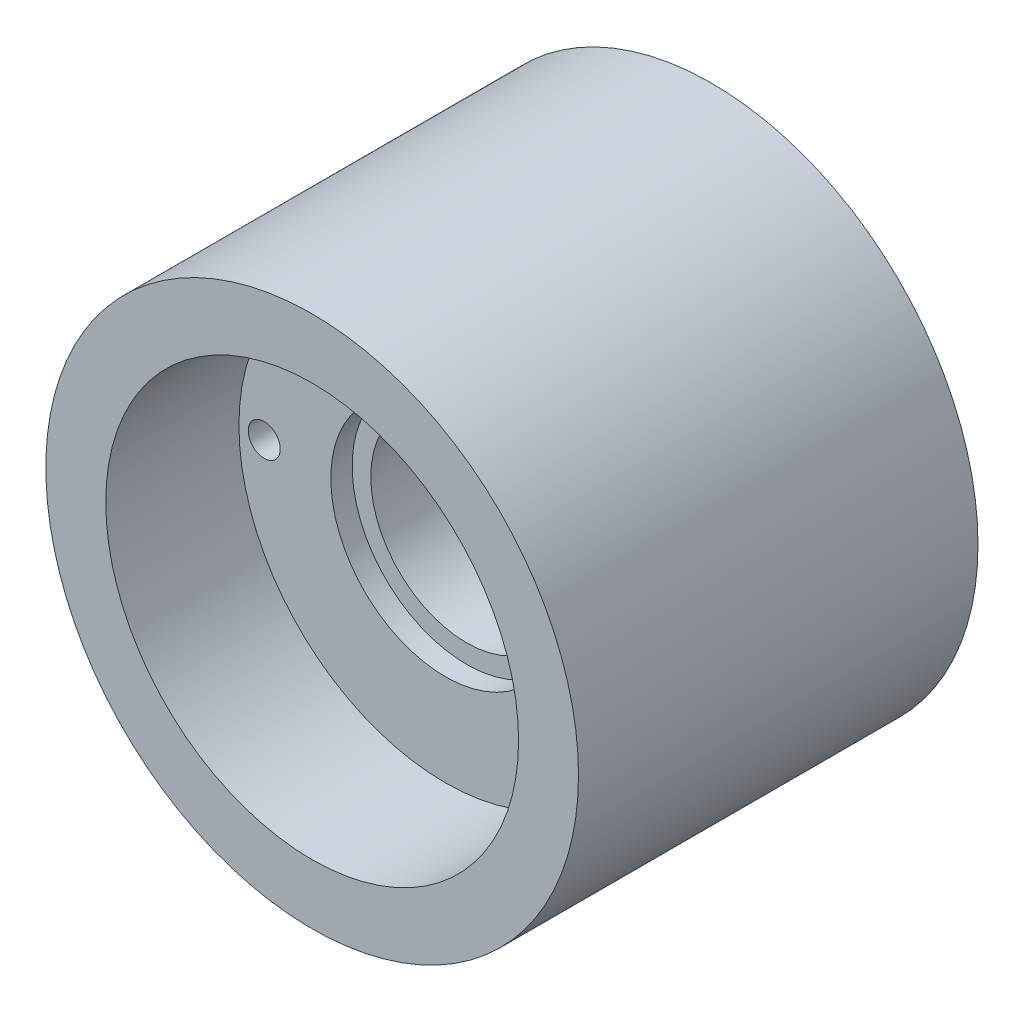
ISO-10303-21;
HEADER;
FILE_DESCRIPTION(('STEP AP214'),'2;1');
FILE_NAME('part.step','',(''),(''),'','','');
FILE_SCHEMA(('AUTOMOTIVE_DESIGN { 1 0 10303 214 1 1 1 1 }'));
ENDSEC;
DATA;
#1=APPLICATION_CONTEXT('core data for automotive mechanical design processes');
#2=APPLICATION_PROTOCOL_DEFINITION('international standard','automotive_design',2000,#1);
#3=PRODUCT_CONTEXT('',#1,'mechanical');
#4=PRODUCT('Part','Part','',(#3));
#5=PRODUCT_RELATED_PRODUCT_CATEGORY('part','',(#4));
#6=PRODUCT_DEFINITION_FORMATION('','',#4);
#7=PRODUCT_DEFINITION_CONTEXT('part definition',#1,'design');
#8=PRODUCT_DEFINITION('design','',#6,#7);
#9=PRODUCT_DEFINITION_SHAPE('','',#8);
#10=(LENGTH_UNIT() NAMED_UNIT(*) SI_UNIT(.MILLI.,.METRE.));
#11=(NAMED_UNIT(*) PLANE_ANGLE_UNIT() SI_UNIT($,.RADIAN.));
#12=(NAMED_UNIT(*) SI_UNIT($,.STERADIAN.) SOLID_ANGLE_UNIT());
#13=UNCERTAINTY_MEASURE_WITH_UNIT(LENGTH_MEASURE(1.E-05),#10,'distance_accuracy_value','');
#14=(GEOMETRIC_REPRESENTATION_CONTEXT(3) GLOBAL_UNCERTAINTY_ASSIGNED_CONTEXT((#13)) GLOBAL_UNIT_ASSIGNED_CONTEXT((#10,
#11,#12)) REPRESENTATION_CONTEXT('',''));
#15=CARTESIAN_POINT('',(0.,0.,0.));
#16=DIRECTION('',(0.,0.,1.));
#17=DIRECTION('',(1.,0.,0.));
#18=AXIS2_PLACEMENT_3D('',#15,#16,#17);
#19=CARTESIAN_POINT('',(0.,0.,10.));
#20=DIRECTION('',(0.,0.,1.));
#21=DIRECTION('',(1.,0.,0.));
#22=AXIS2_PLACEMENT_3D('',#19,#20,#21);
#23=PLANE('',#22);
#24=CARTESIAN_POINT('',(-6.8,0.,10.));
#25=DIRECTION('',(0.,0.,1.));
#26=DIRECTION('',(1.,0.,0.));
#27=AXIS2_PLACEMENT_3D('',#24,#25,#26);
#28=CIRCLE('',#27,0.6);
#29=CARTESIAN_POINT('',(-6.2,0.,10.));
#30=VERTEX_POINT('',#29);
#31=EDGE_CURVE('E68',#30,#30,#28,.T.);
#32=ORIENTED_EDGE('',*,*,#31,.F.);
#33=EDGE_LOOP('',(#32));
#34=FACE_BOUND('',#33,.T.);
#35=CARTESIAN_POINT('',(6.25,0.,10.));
#36=DIRECTION('',(0.,0.,1.));
#37=DIRECTION('',(1.,0.,0.));
#38=AXIS2_PLACEMENT_3D('',#35,#36,#37);
#39=CIRCLE('',#38,1.45);
#40=CARTESIAN_POINT('',(7.7,0.,10.));
#41=VERTEX_POINT('',#40);
#42=EDGE_CURVE('E71',#41,#41,#39,.T.);
#43=ORIENTED_EDGE('',*,*,#42,.F.);
#44=EDGE_LOOP('',(#43));
#45=FACE_BOUND('',#44,.T.);
#46=CARTESIAN_POINT('',(0.,0.,10.));
#47=DIRECTION('',(0.,0.,1.));
#48=DIRECTION('',(1.,0.,0.));
#49=AXIS2_PLACEMENT_3D('',#46,#47,#48);
#50=CIRCLE('',#49,4.3);
#51=CARTESIAN_POINT('',(4.3,0.,10.));
#52=VERTEX_POINT('',#51);
#53=EDGE_CURVE('E55',#52,#52,#50,.T.);
#54=ORIENTED_EDGE('',*,*,#53,.F.);
#55=EDGE_LOOP('',(#54));
#56=FACE_BOUND('',#55,.T.);
#57=CARTESIAN_POINT('',(0.,0.,10.));
#58=DIRECTION('',(0.,0.,1.));
#59=DIRECTION('',(1.,0.,0.));
#60=AXIS2_PLACEMENT_3D('',#57,#58,#59);
#61=CIRCLE('',#60,7.75);
#62=CARTESIAN_POINT('',(7.75,0.,10.));
#63=VERTEX_POINT('',#62);
#64=EDGE_CURVE('E11',#63,#63,#61,.F.);
#65=ORIENTED_EDGE('',*,*,#64,.F.);
#66=EDGE_LOOP('',(#65));
#67=FACE_BOUND('',#66,.T.);
#68=ADVANCED_FACE('F35',(#34,#45,#56,#67),#23,.T.);
#69=CARTESIAN_POINT('',(0.,0.,10.));
#70=DIRECTION('',(0.,0.,-1.));
#71=DIRECTION('',(-1.,0.,0.));
#72=AXIS2_PLACEMENT_3D('',#69,#70,#71);
#73=CYLINDRICAL_SURFACE('',#72,3.6);
#74=CARTESIAN_POINT('',(0.,0.,9.2));
#75=DIRECTION('',(0.,0.,1.));
#76=DIRECTION('',(1.,0.,0.));
#77=AXIS2_PLACEMENT_3D('',#74,#75,#76);
#78=CIRCLE('',#77,3.6);
#79=CARTESIAN_POINT('',(3.6,0.,9.2));
#80=VERTEX_POINT('',#79);
#81=EDGE_CURVE('E78',#80,#80,#78,.T.);
#82=ORIENTED_EDGE('',*,*,#81,.T.);
#83=EDGE_LOOP('',(#82));
#84=FACE_BOUND('',#83,.T.);
#85=CARTESIAN_POINT('',(0.,0.,-1.7));
#86=DIRECTION('',(0.,0.,-1.));
#87=DIRECTION('',(-1.,0.,0.));
#88=AXIS2_PLACEMENT_3D('',#85,#86,#87);
#89=CIRCLE('',#88,3.6);
#90=CARTESIAN_POINT('',(-3.6,0.,-1.7));
#91=VERTEX_POINT('',#90);
#92=EDGE_CURVE('E82',#91,#91,#89,.T.);
#93=ORIENTED_EDGE('',*,*,#92,.T.);
#94=EDGE_LOOP('',(#93));
#95=FACE_BOUND('',#94,.T.);
#96=ADVANCED_FACE('F127',(#84,#95),#73,.F.);
#97=CARTESIAN_POINT('',(0.,0.,0.));
#98=DIRECTION('',(0.,0.,1.));
#99=DIRECTION('',(1.,0.,0.));
#100=AXIS2_PLACEMENT_3D('',#97,#98,#99);
#101=PLANE('',#100);
#102=CARTESIAN_POINT('',(0.,0.,0.));
#103=DIRECTION('',(0.,0.,-1.));
#104=DIRECTION('',(-1.,0.,0.));
#105=AXIS2_PLACEMENT_3D('',#102,#103,#104);
#106=CIRCLE('',#105,5.9);
#107=CARTESIAN_POINT('',(5.7416,-1.35795045564999,0.));
#108=VERTEX_POINT('',#107);
#109=CARTESIAN_POINT('',(5.7416,1.35795045564999,0.));
#110=VERTEX_POINT('',#109);
#111=EDGE_CURVE('E43',#108,#110,#106,.T.);
#112=ORIENTED_EDGE('',*,*,#111,.F.);
#113=CARTESIAN_POINT('',(6.25,0.,0.));
#114=DIRECTION('',(0.,0.,1.));
#115=DIRECTION('',(1.,0.,0.));
#116=AXIS2_PLACEMENT_3D('',#113,#114,#115);
#117=CIRCLE('',#116,1.45);
#118=EDGE_CURVE('E63',#108,#110,#117,.T.);
#119=ORIENTED_EDGE('',*,*,#118,.T.);
#120=EDGE_LOOP('',(#112,#119));
#121=FACE_BOUND('',#120,.T.);
#122=CARTESIAN_POINT('',(0.,0.,0.));
#123=DIRECTION('',(0.,0.,1.));
#124=DIRECTION('',(1.,0.,0.));
#125=AXIS2_PLACEMENT_3D('',#122,#123,#124);
#126=CIRCLE('',#125,10.);
#127=CARTESIAN_POINT('',(10.,0.,0.));
#128=VERTEX_POINT('',#127);
#129=EDGE_CURVE('E64',#128,#128,#126,.T.);
#130=ORIENTED_EDGE('',*,*,#129,.F.);
#131=EDGE_LOOP('',(#130));
#132=FACE_BOUND('',#131,.T.);
#133=CARTESIAN_POINT('',(-6.8,0.,0.));
#134=DIRECTION('',(0.,0.,1.));
#135=DIRECTION('',(1.,0.,0.));
#136=AXIS2_PLACEMENT_3D('',#133,#134,#135);
#137=CIRCLE('',#136,0.6);
#138=CARTESIAN_POINT('',(-6.2,0.,0.));
#139=VERTEX_POINT('',#138);
#140=EDGE_CURVE('E80',#139,#139,#137,.T.);
#141=ORIENTED_EDGE('',*,*,#140,.T.);
#142=EDGE_LOOP('',(#141));
#143=FACE_BOUND('',#142,.T.);
#144=ADVANCED_FACE('F61',(#121,#132,#143),#101,.F.);
#145=CARTESIAN_POINT('',(0.,0.,10.));
#146=DIRECTION('',(0.,0.,-1.));
#147=DIRECTION('',(-1.,0.,0.));
#148=AXIS2_PLACEMENT_3D('',#145,#146,#147);
#149=CYLINDRICAL_SURFACE('',#148,10.);
#150=ORIENTED_EDGE('',*,*,#129,.T.);
#151=EDGE_LOOP('',(#150));
#152=FACE_BOUND('',#151,.T.);
#153=CARTESIAN_POINT('',(0.,0.,15.));
#154=DIRECTION('',(0.,0.,1.));
#155=DIRECTION('',(1.,0.,0.));
#156=AXIS2_PLACEMENT_3D('',#153,#154,#155);
#157=CIRCLE('',#156,10.);
#158=CARTESIAN_POINT('',(10.,0.,15.));
#159=VERTEX_POINT('',#158);
#160=EDGE_CURVE('E96',#159,#159,#157,.T.);
#161=ORIENTED_EDGE('',*,*,#160,.F.);
#162=EDGE_LOOP('',(#161));
#163=FACE_BOUND('',#162,.T.);
#164=ADVANCED_FACE('F37',(#152,#163),#149,.T.);
#165=CARTESIAN_POINT('',(6.25,0.,10.));
#166=DIRECTION('',(0.,0.,-1.));
#167=DIRECTION('',(-1.,0.,0.));
#168=AXIS2_PLACEMENT_3D('',#165,#166,#167);
#169=CYLINDRICAL_SURFACE('',#168,1.45);
#170=ORIENTED_EDGE('',*,*,#42,.T.);
#171=EDGE_LOOP('',(#170));
#172=FACE_BOUND('',#171,.T.);
#173=EDGE_CURVE('E67',#110,#108,#117,.T.);
#174=ORIENTED_EDGE('',*,*,#173,.F.);
#175=ORIENTED_EDGE('',*,*,#118,.F.);
#176=EDGE_LOOP('',(#174,#175));
#177=FACE_BOUND('',#176,.T.);
#178=ADVANCED_FACE('F66',(#172,#177),#169,.F.);
#179=CARTESIAN_POINT('',(-6.8,0.,10.));
#180=DIRECTION('',(0.,0.,-1.));
#181=DIRECTION('',(-1.,0.,0.));
#182=AXIS2_PLACEMENT_3D('',#179,#180,#181);
#183=CYLINDRICAL_SURFACE('',#182,0.6);
#184=ORIENTED_EDGE('',*,*,#31,.T.);
#185=EDGE_LOOP('',(#184));
#186=FACE_BOUND('',#185,.T.);
#187=ORIENTED_EDGE('',*,*,#140,.F.);
#188=EDGE_LOOP('',(#187));
#189=FACE_BOUND('',#188,.T.);
#190=ADVANCED_FACE('F112',(#186,#189),#183,.F.);
#191=CARTESIAN_POINT('',(0.,0.,9.2));
#192=DIRECTION('',(0.,0.,1.));
#193=DIRECTION('',(1.,0.,0.));
#194=AXIS2_PLACEMENT_3D('',#191,#192,#193);
#195=CYLINDRICAL_SURFACE('',#194,4.3);
#196=CARTESIAN_POINT('',(0.,0.,9.2));
#197=DIRECTION('',(0.,0.,1.));
#198=DIRECTION('',(1.,0.,0.));
#199=AXIS2_PLACEMENT_3D('',#196,#197,#198);
#200=CIRCLE('',#199,4.3);
#201=CARTESIAN_POINT('',(4.3,0.,9.2));
#202=VERTEX_POINT('',#201);
#203=EDGE_CURVE('E81',#202,#202,#200,.T.);
#204=ORIENTED_EDGE('',*,*,#203,.F.);
#205=EDGE_LOOP('',(#204));
#206=FACE_BOUND('',#205,.T.);
#207=ORIENTED_EDGE('',*,*,#53,.T.);
#208=EDGE_LOOP('',(#207));
#209=FACE_BOUND('',#208,.T.);
#210=ADVANCED_FACE('F114',(#206,#209),#195,.F.);
#211=CARTESIAN_POINT('',(0.,0.,9.2));
#212=DIRECTION('',(0.,0.,1.));
#213=DIRECTION('',(1.,0.,0.));
#214=AXIS2_PLACEMENT_3D('',#211,#212,#213);
#215=PLANE('',#214);
#216=ORIENTED_EDGE('',*,*,#81,.F.);
#217=EDGE_LOOP('',(#216));
#218=FACE_BOUND('',#217,.T.);
#219=ORIENTED_EDGE('',*,*,#203,.T.);
#220=EDGE_LOOP('',(#219));
#221=FACE_BOUND('',#220,.T.);
#222=ADVANCED_FACE('F121',(#218,#221),#215,.T.);
#223=CARTESIAN_POINT('',(0.,0.,0.));
#224=DIRECTION('',(0.,0.,-1.));
#225=DIRECTION('',(-1.,0.,0.));
#226=AXIS2_PLACEMENT_3D('',#223,#224,#225);
#227=PLANE('',#226);
#228=EDGE_CURVE('E51',#110,#108,#106,.T.);
#229=ORIENTED_EDGE('',*,*,#228,.F.);
#230=ORIENTED_EDGE('',*,*,#173,.T.);
#231=EDGE_LOOP('',(#229,#230));
#232=FACE_BOUND('',#231,.T.);
#233=ADVANCED_FACE('F70',(#232),#227,.F.);
#234=CARTESIAN_POINT('',(0.,0.,-2.5));
#235=DIRECTION('',(0.,0.,-1.));
#236=DIRECTION('',(-1.,0.,0.));
#237=AXIS2_PLACEMENT_3D('',#234,#235,#236);
#238=PLANE('',#237);
#239=CARTESIAN_POINT('',(0.,0.,-2.5));
#240=DIRECTION('',(0.,0.,-1.));
#241=DIRECTION('',(-1.,0.,0.));
#242=AXIS2_PLACEMENT_3D('',#239,#240,#241);
#243=CIRCLE('',#242,4.3);
#244=CARTESIAN_POINT('',(-4.3,0.,-2.5));
#245=VERTEX_POINT('',#244);
#246=EDGE_CURVE('E91',#245,#245,#243,.T.);
#247=ORIENTED_EDGE('',*,*,#246,.F.);
#248=EDGE_LOOP('',(#247));
#249=FACE_BOUND('',#248,.T.);
#250=CARTESIAN_POINT('',(0.,0.,-2.5));
#251=DIRECTION('',(0.,0.,1.));
#252=DIRECTION('',(1.,0.,0.));
#253=AXIS2_PLACEMENT_3D('',#250,#251,#252);
#254=CIRCLE('',#253,5.9);
#255=CARTESIAN_POINT('',(5.9,0.,-2.5));
#256=VERTEX_POINT('',#255);
#257=EDGE_CURVE('E84',#256,#256,#254,.T.);
#258=ORIENTED_EDGE('',*,*,#257,.F.);
#259=EDGE_LOOP('',(#258));
#260=FACE_BOUND('',#259,.T.);
#261=ADVANCED_FACE('F178',(#249,#260),#238,.T.);
#262=CARTESIAN_POINT('',(0.,0.,-1.25));
#263=DIRECTION('',(0.,0.,-1.));
#264=DIRECTION('',(-1.,0.,0.));
#265=AXIS2_PLACEMENT_3D('',#262,#263,#264);
#266=CONICAL_SURFACE('',#265,4.6,0.805003494254653);
#267=ORIENTED_EDGE('',*,*,#257,.T.);
#268=EDGE_LOOP('',(#267));
#269=FACE_BOUND('',#268,.T.);
#270=CARTESIAN_POINT('',(0.,0.,-1.25));
#271=DIRECTION('',(0.,0.,1.));
#272=DIRECTION('',(1.,0.,0.));
#273=AXIS2_PLACEMENT_3D('',#270,#271,#272);
#274=CIRCLE('',#273,4.6);
#275=CARTESIAN_POINT('',(4.6,0.,-1.25));
#276=VERTEX_POINT('',#275);
#277=EDGE_CURVE('E56',#276,#276,#274,.T.);
#278=ORIENTED_EDGE('',*,*,#277,.F.);
#279=EDGE_LOOP('',(#278));
#280=FACE_BOUND('',#279,.T.);
#281=ADVANCED_FACE('F174',(#269,#280),#266,.T.);
#282=CARTESIAN_POINT('',(0.,0.,0.));
#283=DIRECTION('',(0.,0.,1.));
#284=DIRECTION('',(1.,0.,0.));
#285=AXIS2_PLACEMENT_3D('',#282,#283,#284);
#286=CONICAL_SURFACE('',#285,5.9,0.805003494254653);
#287=ORIENTED_EDGE('',*,*,#277,.T.);
#288=EDGE_LOOP('',(#287));
#289=FACE_BOUND('',#288,.T.);
#290=ORIENTED_EDGE('',*,*,#111,.T.);
#291=ORIENTED_EDGE('',*,*,#228,.T.);
#292=EDGE_LOOP('',(#290,#291));
#293=FACE_BOUND('',#292,.T.);
#294=ADVANCED_FACE('F52',(#289,#293),#286,.T.);
#295=CARTESIAN_POINT('',(0.,0.,-1.7));
#296=DIRECTION('',(0.,0.,-1.));
#297=DIRECTION('',(-1.,0.,0.));
#298=AXIS2_PLACEMENT_3D('',#295,#296,#297);
#299=CYLINDRICAL_SURFACE('',#298,4.3);
#300=CARTESIAN_POINT('',(0.,0.,-1.7));
#301=DIRECTION('',(0.,0.,-1.));
#302=DIRECTION('',(-1.,0.,0.));
#303=AXIS2_PLACEMENT_3D('',#300,#301,#302);
#304=CIRCLE('',#303,4.3);
#305=CARTESIAN_POINT('',(-4.3,0.,-1.7));
#306=VERTEX_POINT('',#305);
#307=EDGE_CURVE('E85',#306,#306,#304,.T.);
#308=ORIENTED_EDGE('',*,*,#307,.F.);
#309=EDGE_LOOP('',(#308));
#310=FACE_BOUND('',#309,.T.);
#311=ORIENTED_EDGE('',*,*,#246,.T.);
#312=EDGE_LOOP('',(#311));
#313=FACE_BOUND('',#312,.T.);
#314=ADVANCED_FACE('F165',(#310,#313),#299,.F.);
#315=CARTESIAN_POINT('',(0.,0.,-1.7));
#316=DIRECTION('',(0.,0.,-1.));
#317=DIRECTION('',(-1.,0.,0.));
#318=AXIS2_PLACEMENT_3D('',#315,#316,#317);
#319=PLANE('',#318);
#320=ORIENTED_EDGE('',*,*,#92,.F.);
#321=EDGE_LOOP('',(#320));
#322=FACE_BOUND('',#321,.T.);
#323=ORIENTED_EDGE('',*,*,#307,.T.);
#324=EDGE_LOOP('',(#323));
#325=FACE_BOUND('',#324,.T.);
#326=ADVANCED_FACE('F158',(#322,#325),#319,.T.);
#327=CARTESIAN_POINT('',(0.,0.,15.));
#328=DIRECTION('',(0.,0.,1.));
#329=DIRECTION('',(1.,0.,0.));
#330=AXIS2_PLACEMENT_3D('',#327,#328,#329);
#331=PLANE('',#330);
#332=ORIENTED_EDGE('',*,*,#160,.T.);
#333=EDGE_LOOP('',(#332));
#334=FACE_BOUND('',#333,.T.);
#335=CARTESIAN_POINT('',(0.,0.,15.));
#336=DIRECTION('',(0.,0.,1.));
#337=DIRECTION('',(1.,0.,0.));
#338=AXIS2_PLACEMENT_3D('',#335,#336,#337);
#339=CIRCLE('',#338,7.75);
#340=CARTESIAN_POINT('',(7.75,0.,15.));
#341=VERTEX_POINT('',#340);
#342=EDGE_CURVE('E149',#341,#341,#339,.T.);
#343=ORIENTED_EDGE('',*,*,#342,.F.);
#344=EDGE_LOOP('',(#343));
#345=FACE_BOUND('',#344,.T.);
#346=ADVANCED_FACE('F156',(#334,#345),#331,.T.);
#347=CARTESIAN_POINT('',(0.,0.,15.));
#348=DIRECTION('',(0.,0.,-1.));
#349=DIRECTION('',(-1.,0.,0.));
#350=AXIS2_PLACEMENT_3D('',#347,#348,#349);
#351=CYLINDRICAL_SURFACE('',#350,7.75);
#352=ORIENTED_EDGE('',*,*,#342,.T.);
#353=EDGE_LOOP('',(#352));
#354=FACE_BOUND('',#353,.T.);
#355=ORIENTED_EDGE('',*,*,#64,.T.);
#356=EDGE_LOOP('',(#355));
#357=FACE_BOUND('',#356,.T.);
#358=ADVANCED_FACE('F153',(#354,#357),#351,.F.);
#359=CLOSED_SHELL('',(#68,#96,#144,#164,#178,#190,#210,#222,#233,#261,#281,#294,#314,#326,#346,#358));
#360=MANIFOLD_SOLID_BREP('B2',#359);
#361=ADVANCED_BREP_SHAPE_REPRESENTATION('',(#18,#360),#14);
#362=SHAPE_DEFINITION_REPRESENTATION(#9,#361);
ENDSEC;
END-ISO-10303-21;
